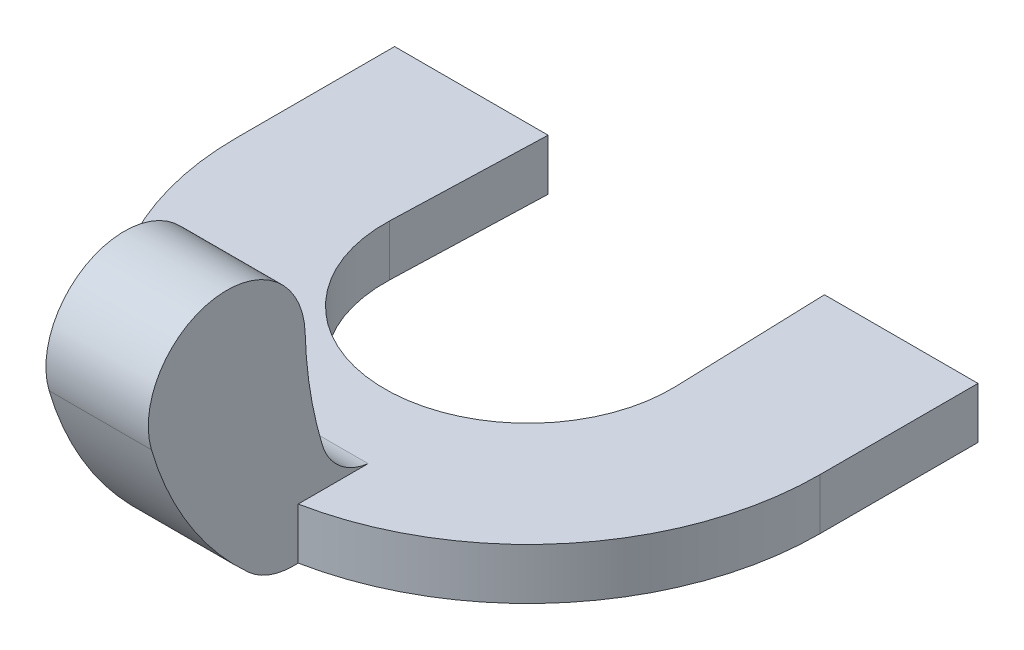
ISO-10303-21;
HEADER;
FILE_DESCRIPTION(('STEP AP214'),'2;1');
FILE_NAME('part.step','',(''),(''),'','','');
FILE_SCHEMA(('AUTOMOTIVE_DESIGN { 1 0 10303 214 1 1 1 1 }'));
ENDSEC;
DATA;
#1=APPLICATION_CONTEXT('core data for automotive mechanical design processes');
#2=APPLICATION_PROTOCOL_DEFINITION('international standard','automotive_design',2000,#1);
#3=PRODUCT_CONTEXT('',#1,'mechanical');
#4=PRODUCT('Part','Part','',(#3));
#5=PRODUCT_RELATED_PRODUCT_CATEGORY('part','',(#4));
#6=PRODUCT_DEFINITION_FORMATION('','',#4);
#7=PRODUCT_DEFINITION_CONTEXT('part definition',#1,'design');
#8=PRODUCT_DEFINITION('design','',#6,#7);
#9=PRODUCT_DEFINITION_SHAPE('','',#8);
#10=(LENGTH_UNIT() NAMED_UNIT(*) SI_UNIT(.MILLI.,.METRE.));
#11=(NAMED_UNIT(*) PLANE_ANGLE_UNIT() SI_UNIT($,.RADIAN.));
#12=(NAMED_UNIT(*) SI_UNIT($,.STERADIAN.) SOLID_ANGLE_UNIT());
#13=UNCERTAINTY_MEASURE_WITH_UNIT(LENGTH_MEASURE(1.E-05),#10,'distance_accuracy_value','');
#14=(GEOMETRIC_REPRESENTATION_CONTEXT(3) GLOBAL_UNCERTAINTY_ASSIGNED_CONTEXT((#13)) GLOBAL_UNIT_ASSIGNED_CONTEXT((#10,
#11,#12)) REPRESENTATION_CONTEXT('',''));
#15=CARTESIAN_POINT('',(0.,0.,0.));
#16=DIRECTION('',(0.,0.,1.));
#17=DIRECTION('',(1.,0.,0.));
#18=AXIS2_PLACEMENT_3D('',#15,#16,#17);
#19=CARTESIAN_POINT('',(2.7,1.,3.09030742807249));
#20=DIRECTION('',(0.,-1.,0.));
#21=DIRECTION('',(0.,0.,-1.));
#22=AXIS2_PLACEMENT_3D('',#19,#20,#21);
#23=CYLINDRICAL_SURFACE('',#22,5.7);
#24=DIRECTION('',(0.,-1.,0.));
#25=VECTOR('',#24,1.);
#26=CARTESIAN_POINT('',(3.8,1.,8.68316000971631));
#27=LINE('',#26,#25);
#28=CARTESIAN_POINT('',(3.8,0.,8.68316000971631));
#29=VERTEX_POINT('',#28);
#30=CARTESIAN_POINT('',(3.8,1.,8.68316000971631));
#31=VERTEX_POINT('',#30);
#32=EDGE_CURVE('E48',#29,#31,#27,.F.);
#33=ORIENTED_EDGE('',*,*,#32,.F.);
#34=CARTESIAN_POINT('',(2.7,0.,3.09030742807249));
#35=DIRECTION('',(0.,1.,0.));
#36=DIRECTION('',(0.,0.,1.));
#37=AXIS2_PLACEMENT_3D('',#34,#35,#36);
#38=CIRCLE('',#37,5.7);
#39=CARTESIAN_POINT('',(8.4,0.,3.09030742807249));
#40=VERTEX_POINT('',#39);
#41=EDGE_CURVE('E150',#29,#40,#38,.T.);
#42=ORIENTED_EDGE('',*,*,#41,.T.);
#43=DIRECTION('',(0.,-1.,0.));
#44=VECTOR('',#43,1.);
#45=CARTESIAN_POINT('',(8.4,1.,3.09030742807249));
#46=LINE('',#45,#44);
#47=CARTESIAN_POINT('',(8.4,1.,3.09030742807249));
#48=VERTEX_POINT('',#47);
#49=EDGE_CURVE('E164',#48,#40,#46,.T.);
#50=ORIENTED_EDGE('',*,*,#49,.F.);
#51=CARTESIAN_POINT('',(2.7,1.,3.09030742807249));
#52=DIRECTION('',(0.,1.,0.));
#53=DIRECTION('',(0.,0.,1.));
#54=AXIS2_PLACEMENT_3D('',#51,#52,#53);
#55=CIRCLE('',#54,5.7);
#56=EDGE_CURVE('E263',#31,#48,#55,.T.);
#57=ORIENTED_EDGE('',*,*,#56,.F.);
#58=EDGE_LOOP('',(#33,#42,#50,#57));
#59=FACE_BOUND('',#58,.T.);
#60=ADVANCED_FACE('F33',(#59),#23,.T.);
#61=CARTESIAN_POINT('',(-0.0984906410812878,1.,2.99838282972995));
#62=DIRECTION('',(-0.999460943243317,0.,-0.0328302136937626));
#63=DIRECTION('',(-0.0328302136937626,0.,0.999460943243317));
#64=AXIS2_PLACEMENT_3D('',#61,#62,#63);
#65=PLANE('',#64);
#66=DIRECTION('',(0.0328302136937626,0.,-0.999460943243317));
#67=VECTOR('',#66,1.);
#68=CARTESIAN_POINT('',(-0.0984906410812878,0.,2.99838282972995));
#69=LINE('',#68,#67);
#70=CARTESIAN_POINT('',(-0.0984906410812889,0.,2.99838282972995));
#71=VERTEX_POINT('',#70);
#72=CARTESIAN_POINT('',(0.,0.,0.));
#73=VERTEX_POINT('',#72);
#74=EDGE_CURVE('E142',#71,#73,#69,.T.);
#75=ORIENTED_EDGE('',*,*,#74,.T.);
#76=DIRECTION('',(0.,-1.,0.));
#77=VECTOR('',#76,1.);
#78=CARTESIAN_POINT('',(0.,1.,0.));
#79=LINE('',#78,#77);
#80=CARTESIAN_POINT('',(0.,1.,0.));
#81=VERTEX_POINT('',#80);
#82=EDGE_CURVE('E11',#81,#73,#79,.T.);
#83=ORIENTED_EDGE('',*,*,#82,.F.);
#84=DIRECTION('',(0.0328302136937626,0.,-0.999460943243317));
#85=VECTOR('',#84,1.);
#86=CARTESIAN_POINT('',(-0.0984906410812878,1.,2.99838282972995));
#87=LINE('',#86,#85);
#88=CARTESIAN_POINT('',(-0.0984906410812889,1.,2.99838282972995));
#89=VERTEX_POINT('',#88);
#90=EDGE_CURVE('E160',#89,#81,#87,.T.);
#91=ORIENTED_EDGE('',*,*,#90,.F.);
#92=DIRECTION('',(0.,-1.,0.));
#93=VECTOR('',#92,1.);
#94=CARTESIAN_POINT('',(-0.0984906410812889,1.,2.99838282972995));
#95=LINE('',#94,#93);
#96=EDGE_CURVE('E138',#89,#71,#95,.T.);
#97=ORIENTED_EDGE('',*,*,#96,.T.);
#98=EDGE_LOOP('',(#75,#83,#91,#97));
#99=FACE_BOUND('',#98,.T.);
#100=ADVANCED_FACE('F35',(#99),#65,.F.);
#101=CARTESIAN_POINT('',(0.,1.,0.));
#102=DIRECTION('',(0.,0.,1.));
#103=DIRECTION('',(1.,0.,0.));
#104=AXIS2_PLACEMENT_3D('',#101,#102,#103);
#105=PLANE('',#104);
#106=DIRECTION('',(-1.,0.,0.));
#107=VECTOR('',#106,1.);
#108=CARTESIAN_POINT('',(0.,0.,0.));
#109=LINE('',#108,#107);
#110=CARTESIAN_POINT('',(-3.,0.,0.));
#111=VERTEX_POINT('',#110);
#112=EDGE_CURVE('E145',#73,#111,#109,.T.);
#113=ORIENTED_EDGE('',*,*,#112,.T.);
#114=DIRECTION('',(0.,-1.,0.));
#115=VECTOR('',#114,1.);
#116=CARTESIAN_POINT('',(-3.,1.,0.));
#117=LINE('',#116,#115);
#118=CARTESIAN_POINT('',(-3.,1.,0.));
#119=VERTEX_POINT('',#118);
#120=EDGE_CURVE('E41',#119,#111,#117,.T.);
#121=ORIENTED_EDGE('',*,*,#120,.F.);
#122=DIRECTION('',(-1.,0.,0.));
#123=VECTOR('',#122,1.);
#124=CARTESIAN_POINT('',(0.,1.,0.));
#125=LINE('',#124,#123);
#126=EDGE_CURVE('E98',#81,#119,#125,.T.);
#127=ORIENTED_EDGE('',*,*,#126,.F.);
#128=ORIENTED_EDGE('',*,*,#82,.T.);
#129=EDGE_LOOP('',(#113,#121,#127,#128));
#130=FACE_BOUND('',#129,.T.);
#131=ADVANCED_FACE('F274',(#130),#105,.F.);
#132=CARTESIAN_POINT('',(-3.,1.,0.));
#133=DIRECTION('',(1.,0.,0.));
#134=DIRECTION('',(0.,0.,-1.));
#135=AXIS2_PLACEMENT_3D('',#132,#133,#134);
#136=PLANE('',#135);
#137=DIRECTION('',(0.,0.,1.));
#138=VECTOR('',#137,1.);
#139=CARTESIAN_POINT('',(-3.,0.,0.));
#140=LINE('',#139,#138);
#141=CARTESIAN_POINT('',(-3.,0.,3.09030742807249));
#142=VERTEX_POINT('',#141);
#143=EDGE_CURVE('E148',#111,#142,#140,.T.);
#144=ORIENTED_EDGE('',*,*,#143,.T.);
#145=DIRECTION('',(0.,-1.,0.));
#146=VECTOR('',#145,1.);
#147=CARTESIAN_POINT('',(-3.,1.,3.09030742807249));
#148=LINE('',#147,#146);
#149=CARTESIAN_POINT('',(-3.,1.,3.09030742807249));
#150=VERTEX_POINT('',#149);
#151=EDGE_CURVE('E167',#150,#142,#148,.T.);
#152=ORIENTED_EDGE('',*,*,#151,.F.);
#153=DIRECTION('',(0.,0.,1.));
#154=VECTOR('',#153,1.);
#155=CARTESIAN_POINT('',(-3.,1.,0.));
#156=LINE('',#155,#154);
#157=EDGE_CURVE('E175',#119,#150,#156,.T.);
#158=ORIENTED_EDGE('',*,*,#157,.F.);
#159=ORIENTED_EDGE('',*,*,#120,.T.);
#160=EDGE_LOOP('',(#144,#152,#158,#159));
#161=FACE_BOUND('',#160,.T.);
#162=ADVANCED_FACE('F173',(#161),#136,.F.);
#163=CARTESIAN_POINT('',(1.8,0.,8.7188063398606));
#164=VERTEX_POINT('',#163);
#165=EDGE_CURVE('E151',#142,#164,#38,.T.);
#166=ORIENTED_EDGE('',*,*,#165,.T.);
#167=DIRECTION('',(0.,-1.,0.));
#168=VECTOR('',#167,1.);
#169=CARTESIAN_POINT('',(1.8,1.,8.7188063398606));
#170=LINE('',#169,#168);
#171=CARTESIAN_POINT('',(1.8,1.,8.7188063398606));
#172=VERTEX_POINT('',#171);
#173=EDGE_CURVE('E146',#164,#172,#170,.F.);
#174=ORIENTED_EDGE('',*,*,#173,.T.);
#175=EDGE_CURVE('E264',#150,#172,#55,.T.);
#176=ORIENTED_EDGE('',*,*,#175,.F.);
#177=ORIENTED_EDGE('',*,*,#151,.T.);
#178=EDGE_LOOP('',(#166,#174,#176,#177));
#179=FACE_BOUND('',#178,.T.);
#180=ADVANCED_FACE('F188',(#179),#23,.T.);
#181=CARTESIAN_POINT('',(8.4,1.,3.09030742807249));
#182=DIRECTION('',(-1.,0.,0.));
#183=DIRECTION('',(0.,0.,1.));
#184=AXIS2_PLACEMENT_3D('',#181,#182,#183);
#185=PLANE('',#184);
#186=DIRECTION('',(0.,0.,-1.));
#187=VECTOR('',#186,1.);
#188=CARTESIAN_POINT('',(8.4,0.,3.09030742807249));
#189=LINE('',#188,#187);
#190=CARTESIAN_POINT('',(8.4,0.,0.));
#191=VERTEX_POINT('',#190);
#192=EDGE_CURVE('E154',#40,#191,#189,.T.);
#193=ORIENTED_EDGE('',*,*,#192,.T.);
#194=DIRECTION('',(0.,-1.,0.));
#195=VECTOR('',#194,1.);
#196=CARTESIAN_POINT('',(8.4,1.,0.));
#197=LINE('',#196,#195);
#198=CARTESIAN_POINT('',(8.4,1.,0.));
#199=VERTEX_POINT('',#198);
#200=EDGE_CURVE('E133',#199,#191,#197,.T.);
#201=ORIENTED_EDGE('',*,*,#200,.F.);
#202=DIRECTION('',(0.,0.,-1.));
#203=VECTOR('',#202,1.);
#204=CARTESIAN_POINT('',(8.4,1.,3.09030742807249));
#205=LINE('',#204,#203);
#206=EDGE_CURVE('E121',#48,#199,#205,.T.);
#207=ORIENTED_EDGE('',*,*,#206,.F.);
#208=ORIENTED_EDGE('',*,*,#49,.T.);
#209=EDGE_LOOP('',(#193,#201,#207,#208));
#210=FACE_BOUND('',#209,.T.);
#211=ADVANCED_FACE('F269',(#210),#185,.F.);
#212=CARTESIAN_POINT('',(8.4,1.,0.));
#213=DIRECTION('',(0.,0.,1.));
#214=DIRECTION('',(1.,0.,0.));
#215=AXIS2_PLACEMENT_3D('',#212,#213,#214);
#216=PLANE('',#215);
#217=DIRECTION('',(-1.,0.,0.));
#218=VECTOR('',#217,1.);
#219=CARTESIAN_POINT('',(8.4,0.,0.));
#220=LINE('',#219,#218);
#221=CARTESIAN_POINT('',(5.4,0.,0.));
#222=VERTEX_POINT('',#221);
#223=EDGE_CURVE('E130',#191,#222,#220,.T.);
#224=ORIENTED_EDGE('',*,*,#223,.T.);
#225=DIRECTION('',(0.,-1.,0.));
#226=VECTOR('',#225,1.);
#227=CARTESIAN_POINT('',(5.4,1.,0.));
#228=LINE('',#227,#226);
#229=CARTESIAN_POINT('',(5.4,1.,0.));
#230=VERTEX_POINT('',#229);
#231=EDGE_CURVE('E127',#230,#222,#228,.T.);
#232=ORIENTED_EDGE('',*,*,#231,.F.);
#233=DIRECTION('',(-1.,0.,0.));
#234=VECTOR('',#233,1.);
#235=CARTESIAN_POINT('',(8.4,1.,0.));
#236=LINE('',#235,#234);
#237=EDGE_CURVE('E113',#199,#230,#236,.T.);
#238=ORIENTED_EDGE('',*,*,#237,.F.);
#239=ORIENTED_EDGE('',*,*,#200,.T.);
#240=EDGE_LOOP('',(#224,#232,#238,#239));
#241=FACE_BOUND('',#240,.T.);
#242=ADVANCED_FACE('F128',(#241),#216,.F.);
#243=CARTESIAN_POINT('',(5.4,1.,0.));
#244=DIRECTION('',(0.999460943243317,0.,-0.0328302136937634));
#245=DIRECTION('',(-0.0328302136937634,0.,-0.999460943243317));
#246=AXIS2_PLACEMENT_3D('',#243,#244,#245);
#247=PLANE('',#246);
#248=DIRECTION('',(0.0328302136937634,0.,0.999460943243317));
#249=VECTOR('',#248,1.);
#250=CARTESIAN_POINT('',(5.4,0.,0.));
#251=LINE('',#250,#249);
#252=CARTESIAN_POINT('',(5.49849064108129,0.,2.99838282972995));
#253=VERTEX_POINT('',#252);
#254=EDGE_CURVE('E157',#222,#253,#251,.T.);
#255=ORIENTED_EDGE('',*,*,#254,.T.);
#256=DIRECTION('',(0.,-1.,0.));
#257=VECTOR('',#256,1.);
#258=CARTESIAN_POINT('',(5.49849064108129,1.,2.99838282972995));
#259=LINE('',#258,#257);
#260=CARTESIAN_POINT('',(5.49849064108129,1.,2.99838282972995));
#261=VERTEX_POINT('',#260);
#262=EDGE_CURVE('E134',#261,#253,#259,.T.);
#263=ORIENTED_EDGE('',*,*,#262,.F.);
#264=DIRECTION('',(0.0328302136937634,0.,0.999460943243317));
#265=VECTOR('',#264,1.);
#266=CARTESIAN_POINT('',(5.4,1.,0.));
#267=LINE('',#266,#265);
#268=EDGE_CURVE('E118',#230,#261,#267,.T.);
#269=ORIENTED_EDGE('',*,*,#268,.F.);
#270=ORIENTED_EDGE('',*,*,#231,.T.);
#271=EDGE_LOOP('',(#255,#263,#269,#270));
#272=FACE_BOUND('',#271,.T.);
#273=ADVANCED_FACE('F136',(#272),#247,.F.);
#274=CARTESIAN_POINT('',(2.7,1.,3.09030742807249));
#275=DIRECTION('',(0.,-1.,0.));
#276=DIRECTION('',(0.,0.,-1.));
#277=AXIS2_PLACEMENT_3D('',#274,#275,#276);
#278=CYLINDRICAL_SURFACE('',#277,2.8);
#279=CARTESIAN_POINT('',(2.7,0.,3.09030742807249));
#280=DIRECTION('',(0.,-1.,0.));
#281=DIRECTION('',(0.,0.,-1.));
#282=AXIS2_PLACEMENT_3D('',#279,#280,#281);
#283=CIRCLE('',#282,2.8);
#284=EDGE_CURVE('E90',#253,#71,#283,.T.);
#285=ORIENTED_EDGE('',*,*,#284,.T.);
#286=ORIENTED_EDGE('',*,*,#96,.F.);
#287=CARTESIAN_POINT('',(2.7,1.,3.09030742807249));
#288=DIRECTION('',(0.,-1.,0.));
#289=DIRECTION('',(0.,0.,-1.));
#290=AXIS2_PLACEMENT_3D('',#287,#288,#289);
#291=CIRCLE('',#290,2.8);
#292=EDGE_CURVE('E57',#261,#89,#291,.T.);
#293=ORIENTED_EDGE('',*,*,#292,.F.);
#294=ORIENTED_EDGE('',*,*,#262,.T.);
#295=EDGE_LOOP('',(#285,#286,#293,#294));
#296=FACE_BOUND('',#295,.T.);
#297=ADVANCED_FACE('F270',(#296),#278,.F.);
#298=CARTESIAN_POINT('',(2.7,1.,3.09030742807249));
#299=DIRECTION('',(0.,1.,0.));
#300=DIRECTION('',(0.,0.,1.));
#301=AXIS2_PLACEMENT_3D('',#298,#299,#300);
#302=PLANE('',#301);
#303=DIRECTION('',(0.,0.,1.));
#304=VECTOR('',#303,1.);
#305=CARTESIAN_POINT('',(1.8,1.,3.09030742807249));
#306=LINE('',#305,#304);
#307=CARTESIAN_POINT('',(1.8,0.999999999999999,7.31611721362335));
#308=VERTEX_POINT('',#307);
#309=EDGE_CURVE('E249',#308,#172,#306,.T.);
#310=ORIENTED_EDGE('',*,*,#309,.F.);
#311=DIRECTION('',(1.,0.,0.));
#312=VECTOR('',#311,1.);
#313=CARTESIAN_POINT('',(1.8,0.999999999999999,7.31611721362335));
#314=LINE('',#313,#312);
#315=CARTESIAN_POINT('',(3.8,0.999999999999999,7.31611721362335));
#316=VERTEX_POINT('',#315);
#317=EDGE_CURVE('E244',#308,#316,#314,.T.);
#318=ORIENTED_EDGE('',*,*,#317,.T.);
#319=DIRECTION('',(0.,0.,1.));
#320=VECTOR('',#319,1.);
#321=CARTESIAN_POINT('',(3.8,1.,3.09030742807249));
#322=LINE('',#321,#320);
#323=EDGE_CURVE('E231',#316,#31,#322,.T.);
#324=ORIENTED_EDGE('',*,*,#323,.T.);
#325=ORIENTED_EDGE('',*,*,#56,.T.);
#326=ORIENTED_EDGE('',*,*,#206,.T.);
#327=ORIENTED_EDGE('',*,*,#237,.T.);
#328=ORIENTED_EDGE('',*,*,#268,.T.);
#329=ORIENTED_EDGE('',*,*,#292,.T.);
#330=ORIENTED_EDGE('',*,*,#90,.T.);
#331=ORIENTED_EDGE('',*,*,#126,.T.);
#332=ORIENTED_EDGE('',*,*,#157,.T.);
#333=ORIENTED_EDGE('',*,*,#175,.T.);
#334=EDGE_LOOP('',(#310,#318,#324,#325,#326,#327,#328,#329,#330,#331,#332,#333));
#335=FACE_BOUND('',#334,.T.);
#336=ADVANCED_FACE('F116',(#335),#302,.T.);
#337=CARTESIAN_POINT('',(2.7,0.,3.09030742807249));
#338=DIRECTION('',(0.,1.,0.));
#339=DIRECTION('',(0.,0.,1.));
#340=AXIS2_PLACEMENT_3D('',#337,#338,#339);
#341=PLANE('',#340);
#342=ORIENTED_EDGE('',*,*,#41,.F.);
#343=DIRECTION('',(0.,0.,-1.));
#344=VECTOR('',#343,1.);
#345=CARTESIAN_POINT('',(3.8,0.,6.33521004215524));
#346=LINE('',#345,#344);
#347=CARTESIAN_POINT('',(3.8,0.,8.79030742807249));
#348=VERTEX_POINT('',#347);
#349=EDGE_CURVE('E437',#348,#29,#346,.T.);
#350=ORIENTED_EDGE('',*,*,#349,.F.);
#351=DIRECTION('',(1.,0.,0.));
#352=VECTOR('',#351,1.);
#353=CARTESIAN_POINT('',(1.8,0.,8.79030742807249));
#354=LINE('',#353,#352);
#355=CARTESIAN_POINT('',(1.8,0.,8.79030742807249));
#356=VERTEX_POINT('',#355);
#357=EDGE_CURVE('E239',#356,#348,#354,.T.);
#358=ORIENTED_EDGE('',*,*,#357,.F.);
#359=DIRECTION('',(0.,0.,-1.));
#360=VECTOR('',#359,1.);
#361=CARTESIAN_POINT('',(1.8,0.,6.33521004215524));
#362=LINE('',#361,#360);
#363=EDGE_CURVE('E185',#356,#164,#362,.T.);
#364=ORIENTED_EDGE('',*,*,#363,.T.);
#365=ORIENTED_EDGE('',*,*,#165,.F.);
#366=ORIENTED_EDGE('',*,*,#143,.F.);
#367=ORIENTED_EDGE('',*,*,#112,.F.);
#368=ORIENTED_EDGE('',*,*,#74,.F.);
#369=ORIENTED_EDGE('',*,*,#284,.F.);
#370=ORIENTED_EDGE('',*,*,#254,.F.);
#371=ORIENTED_EDGE('',*,*,#223,.F.);
#372=ORIENTED_EDGE('',*,*,#192,.F.);
#373=EDGE_LOOP('',(#342,#350,#358,#364,#365,#366,#367,#368,#369,#370,#371,#372));
#374=FACE_BOUND('',#373,.T.);
#375=ADVANCED_FACE('F179',(#374),#341,.F.);
#376=CARTESIAN_POINT('',(1.8,1.29067591450349,8.79030742807249));
#377=DIRECTION('',(-1.,0.,0.));
#378=DIRECTION('',(0.,0.,1.));
#379=AXIS2_PLACEMENT_3D('',#376,#377,#378);
#380=PLANE('',#379);
#381=ORIENTED_EDGE('',*,*,#173,.F.);
#382=ORIENTED_EDGE('',*,*,#363,.F.);
#383=CARTESIAN_POINT('',(1.8,1.29067591450349,8.79030742807249));
#384=DIRECTION('',(1.,0.,0.));
#385=DIRECTION('',(0.,0.,1.));
#386=AXIS2_PLACEMENT_3D('',#383,#384,#385);
#387=CIRCLE('',#386,1.29067591450349);
#388=CARTESIAN_POINT('',(1.8,0.333789577966693,9.6564557151623));
#389=VERTEX_POINT('',#388);
#390=EDGE_CURVE('E253',#389,#356,#387,.T.);
#391=ORIENTED_EDGE('',*,*,#390,.F.);
#392=CARTESIAN_POINT('',(1.8,5.2038418657983,5.24821276500191));
#393=DIRECTION('',(1.,0.,0.));
#394=DIRECTION('',(0.,0.,1.));
#395=AXIS2_PLACEMENT_3D('',#392,#393,#394);
#396=CIRCLE('',#395,6.56886711647089);
#397=CARTESIAN_POINT('',(1.8,3.35065030733946,11.5502518192691));
#398=VERTEX_POINT('',#397);
#399=EDGE_CURVE('E453',#398,#389,#396,.T.);
#400=ORIENTED_EDGE('',*,*,#399,.F.);
#401=CARTESIAN_POINT('',(1.8,3.78306219627606,10.0797742535964));
#402=DIRECTION('',(1.,0.,0.));
#403=DIRECTION('',(0.,0.,1.));
#404=AXIS2_PLACEMENT_3D('',#401,#402,#403);
#405=CIRCLE('',#404,1.53273752248736);
#406=CARTESIAN_POINT('',(1.8,3.82892823619334,8.54772313851468));
#407=VERTEX_POINT('',#406);
#408=EDGE_CURVE('E450',#407,#398,#405,.T.);
#409=ORIENTED_EDGE('',*,*,#408,.F.);
#410=CARTESIAN_POINT('',(1.8,4.06832233593643,0.55130578666214));
#411=DIRECTION('',(-1.,0.,0.));
#412=DIRECTION('',(0.,0.,-1.));
#413=AXIS2_PLACEMENT_3D('',#410,#411,#412);
#414=CIRCLE('',#413,8.00000000000001);
#415=CARTESIAN_POINT('',(1.8,1.75623081809673,8.2099109346727));
#416=VERTEX_POINT('',#415);
#417=EDGE_CURVE('E444',#416,#407,#414,.T.);
#418=ORIENTED_EDGE('',*,*,#417,.F.);
#419=CARTESIAN_POINT('',(1.8,2.06714580726453,7.18003165945307));
#420=DIRECTION('',(-1.,0.,0.));
#421=DIRECTION('',(0.,0.,-1.));
#422=AXIS2_PLACEMENT_3D('',#419,#420,#421);
#423=CIRCLE('',#422,1.07578782853131);
#424=EDGE_CURVE('E442',#308,#416,#423,.T.);
#425=ORIENTED_EDGE('',*,*,#424,.F.);
#426=ORIENTED_EDGE('',*,*,#309,.T.);
#427=EDGE_LOOP('',(#381,#382,#391,#400,#409,#418,#425,#426));
#428=FACE_BOUND('',#427,.T.);
#429=ADVANCED_FACE('F301',(#428),#380,.T.);
#430=CARTESIAN_POINT('',(3.8,1.29067591450349,8.79030742807249));
#431=DIRECTION('',(-1.,0.,0.));
#432=DIRECTION('',(0.,0.,1.));
#433=AXIS2_PLACEMENT_3D('',#430,#431,#432);
#434=PLANE('',#433);
#435=ORIENTED_EDGE('',*,*,#349,.T.);
#436=ORIENTED_EDGE('',*,*,#32,.T.);
#437=ORIENTED_EDGE('',*,*,#323,.F.);
#438=CARTESIAN_POINT('',(3.8,2.06714580726453,7.18003165945307));
#439=DIRECTION('',(-1.,0.,0.));
#440=DIRECTION('',(0.,0.,-1.));
#441=AXIS2_PLACEMENT_3D('',#438,#439,#440);
#442=CIRCLE('',#441,1.07578782853131);
#443=CARTESIAN_POINT('',(3.8,1.75623081809673,8.2099109346727));
#444=VERTEX_POINT('',#443);
#445=EDGE_CURVE('E235',#316,#444,#442,.T.);
#446=ORIENTED_EDGE('',*,*,#445,.T.);
#447=CARTESIAN_POINT('',(3.8,4.06832233593643,0.55130578666214));
#448=DIRECTION('',(-1.,0.,0.));
#449=DIRECTION('',(0.,0.,-1.));
#450=AXIS2_PLACEMENT_3D('',#447,#448,#449);
#451=CIRCLE('',#450,8.00000000000001);
#452=CARTESIAN_POINT('',(3.8,3.82892823619334,8.54772313851468));
#453=VERTEX_POINT('',#452);
#454=EDGE_CURVE('E247',#444,#453,#451,.T.);
#455=ORIENTED_EDGE('',*,*,#454,.T.);
#456=CARTESIAN_POINT('',(3.8,3.78306219627606,10.0797742535964));
#457=DIRECTION('',(1.,0.,0.));
#458=DIRECTION('',(0.,0.,1.));
#459=AXIS2_PLACEMENT_3D('',#456,#457,#458);
#460=CIRCLE('',#459,1.53273752248736);
#461=CARTESIAN_POINT('',(3.8,3.35065030733946,11.5502518192691));
#462=VERTEX_POINT('',#461);
#463=EDGE_CURVE('E462',#453,#462,#460,.T.);
#464=ORIENTED_EDGE('',*,*,#463,.T.);
#465=CARTESIAN_POINT('',(3.8,5.2038418657983,5.24821276500191));
#466=DIRECTION('',(1.,0.,0.));
#467=DIRECTION('',(0.,0.,1.));
#468=AXIS2_PLACEMENT_3D('',#465,#466,#467);
#469=CIRCLE('',#468,6.56886711647089);
#470=CARTESIAN_POINT('',(3.8,0.333789577966693,9.6564557151623));
#471=VERTEX_POINT('',#470);
#472=EDGE_CURVE('E440',#462,#471,#469,.T.);
#473=ORIENTED_EDGE('',*,*,#472,.T.);
#474=CARTESIAN_POINT('',(3.8,1.29067591450349,8.79030742807249));
#475=DIRECTION('',(1.,0.,0.));
#476=DIRECTION('',(0.,0.,1.));
#477=AXIS2_PLACEMENT_3D('',#474,#475,#476);
#478=CIRCLE('',#477,1.29067591450349);
#479=EDGE_CURVE('E431',#471,#348,#478,.T.);
#480=ORIENTED_EDGE('',*,*,#479,.T.);
#481=EDGE_LOOP('',(#435,#436,#437,#446,#455,#464,#473,#480));
#482=FACE_BOUND('',#481,.T.);
#483=ADVANCED_FACE('F233',(#482),#434,.F.);
#484=CARTESIAN_POINT('',(1.8,1.29067591450349,8.79030742807249));
#485=DIRECTION('',(1.,0.,0.));
#486=DIRECTION('',(0.,0.,-1.));
#487=AXIS2_PLACEMENT_3D('',#484,#485,#486);
#488=CYLINDRICAL_SURFACE('',#487,1.29067591450349);
#489=ORIENTED_EDGE('',*,*,#357,.T.);
#490=ORIENTED_EDGE('',*,*,#479,.F.);
#491=DIRECTION('',(1.,0.,0.));
#492=VECTOR('',#491,1.);
#493=CARTESIAN_POINT('',(1.8,0.333789577966693,9.6564557151623));
#494=LINE('',#493,#492);
#495=EDGE_CURVE('E434',#389,#471,#494,.T.);
#496=ORIENTED_EDGE('',*,*,#495,.F.);
#497=ORIENTED_EDGE('',*,*,#390,.T.);
#498=EDGE_LOOP('',(#489,#490,#496,#497));
#499=FACE_BOUND('',#498,.T.);
#500=ADVANCED_FACE('F317',(#499),#488,.T.);
#501=CARTESIAN_POINT('',(1.8,5.2038418657983,5.24821276500191));
#502=DIRECTION('',(1.,0.,0.));
#503=DIRECTION('',(0.,0.,-1.));
#504=AXIS2_PLACEMENT_3D('',#501,#502,#503);
#505=CYLINDRICAL_SURFACE('',#504,6.56886711647089);
#506=ORIENTED_EDGE('',*,*,#495,.T.);
#507=ORIENTED_EDGE('',*,*,#472,.F.);
#508=DIRECTION('',(1.,0.,0.));
#509=VECTOR('',#508,1.);
#510=CARTESIAN_POINT('',(1.8,3.35065030733946,11.5502518192691));
#511=LINE('',#510,#509);
#512=EDGE_CURVE('E458',#398,#462,#511,.T.);
#513=ORIENTED_EDGE('',*,*,#512,.F.);
#514=ORIENTED_EDGE('',*,*,#399,.T.);
#515=EDGE_LOOP('',(#506,#507,#513,#514));
#516=FACE_BOUND('',#515,.T.);
#517=ADVANCED_FACE('F313',(#516),#505,.T.);
#518=CARTESIAN_POINT('',(1.8,3.78306219627606,10.0797742535964));
#519=DIRECTION('',(1.,0.,0.));
#520=DIRECTION('',(0.,0.,-1.));
#521=AXIS2_PLACEMENT_3D('',#518,#519,#520);
#522=CYLINDRICAL_SURFACE('',#521,1.53273752248736);
#523=ORIENTED_EDGE('',*,*,#512,.T.);
#524=ORIENTED_EDGE('',*,*,#463,.F.);
#525=DIRECTION('',(1.,0.,0.));
#526=VECTOR('',#525,1.);
#527=CARTESIAN_POINT('',(1.8,3.82892823619334,8.54772313851468));
#528=LINE('',#527,#526);
#529=EDGE_CURVE('E251',#407,#453,#528,.T.);
#530=ORIENTED_EDGE('',*,*,#529,.F.);
#531=ORIENTED_EDGE('',*,*,#408,.T.);
#532=EDGE_LOOP('',(#523,#524,#530,#531));
#533=FACE_BOUND('',#532,.T.);
#534=ADVANCED_FACE('F309',(#533),#522,.T.);
#535=CARTESIAN_POINT('',(1.8,4.06832233593643,0.55130578666214));
#536=DIRECTION('',(1.,0.,0.));
#537=DIRECTION('',(0.,0.,-1.));
#538=AXIS2_PLACEMENT_3D('',#535,#536,#537);
#539=CYLINDRICAL_SURFACE('',#538,8.00000000000001);
#540=ORIENTED_EDGE('',*,*,#529,.T.);
#541=ORIENTED_EDGE('',*,*,#454,.F.);
#542=DIRECTION('',(1.,0.,0.));
#543=VECTOR('',#542,1.);
#544=CARTESIAN_POINT('',(1.8,1.75623081809673,8.2099109346727));
#545=LINE('',#544,#543);
#546=EDGE_CURVE('E246',#416,#444,#545,.T.);
#547=ORIENTED_EDGE('',*,*,#546,.F.);
#548=ORIENTED_EDGE('',*,*,#417,.T.);
#549=EDGE_LOOP('',(#540,#541,#547,#548));
#550=FACE_BOUND('',#549,.T.);
#551=ADVANCED_FACE('F306',(#550),#539,.F.);
#552=CARTESIAN_POINT('',(1.8,2.06714580726453,7.18003165945307));
#553=DIRECTION('',(1.,0.,0.));
#554=DIRECTION('',(0.,0.,-1.));
#555=AXIS2_PLACEMENT_3D('',#552,#553,#554);
#556=CYLINDRICAL_SURFACE('',#555,1.07578782853131);
#557=ORIENTED_EDGE('',*,*,#546,.T.);
#558=ORIENTED_EDGE('',*,*,#445,.F.);
#559=ORIENTED_EDGE('',*,*,#317,.F.);
#560=ORIENTED_EDGE('',*,*,#424,.T.);
#561=EDGE_LOOP('',(#557,#558,#559,#560));
#562=FACE_BOUND('',#561,.T.);
#563=ADVANCED_FACE('F242',(#562),#556,.F.);
#564=CLOSED_SHELL('',(#60,#100,#131,#162,#180,#211,#242,#273,#297,#336,#375,#429,#483,#500,#517,
#534,#551,#563));
#565=MANIFOLD_SOLID_BREP('B2',#564);
#566=ADVANCED_BREP_SHAPE_REPRESENTATION('',(#18,#565),#14);
#567=SHAPE_DEFINITION_REPRESENTATION(#9,#566);
ENDSEC;
END-ISO-10303-21;
